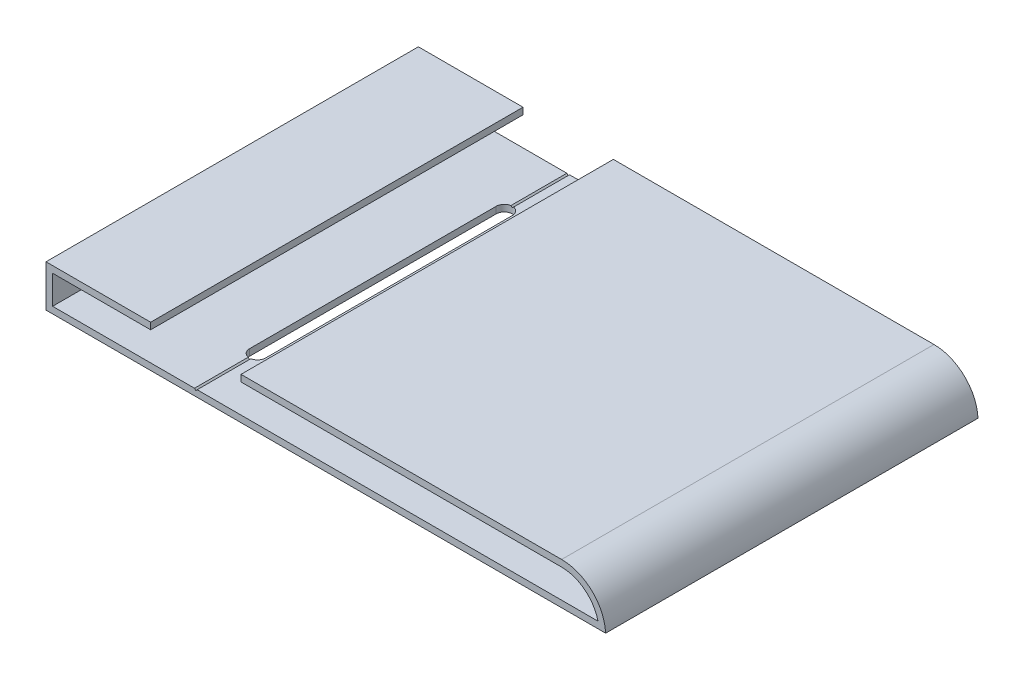
ISO-10303-21;
HEADER;
FILE_DESCRIPTION(('STEP AP214'),'2;1');
FILE_NAME('part.step','',(''),(''),'','','');
FILE_SCHEMA(('AUTOMOTIVE_DESIGN { 1 0 10303 214 1 1 1 1 }'));
ENDSEC;
DATA;
#1=APPLICATION_CONTEXT('core data for automotive mechanical design processes');
#2=APPLICATION_PROTOCOL_DEFINITION('international standard','automotive_design',2000,#1);
#3=PRODUCT_CONTEXT('',#1,'mechanical');
#4=PRODUCT('Part','Part','',(#3));
#5=PRODUCT_RELATED_PRODUCT_CATEGORY('part','',(#4));
#6=PRODUCT_DEFINITION_FORMATION('','',#4);
#7=PRODUCT_DEFINITION_CONTEXT('part definition',#1,'design');
#8=PRODUCT_DEFINITION('design','',#6,#7);
#9=PRODUCT_DEFINITION_SHAPE('','',#8);
#10=(LENGTH_UNIT() NAMED_UNIT(*) SI_UNIT(.MILLI.,.METRE.));
#11=(NAMED_UNIT(*) PLANE_ANGLE_UNIT() SI_UNIT($,.RADIAN.));
#12=(NAMED_UNIT(*) SI_UNIT($,.STERADIAN.) SOLID_ANGLE_UNIT());
#13=UNCERTAINTY_MEASURE_WITH_UNIT(LENGTH_MEASURE(1.E-05),#10,'distance_accuracy_value','');
#14=(GEOMETRIC_REPRESENTATION_CONTEXT(3) GLOBAL_UNCERTAINTY_ASSIGNED_CONTEXT((#13)) GLOBAL_UNIT_ASSIGNED_CONTEXT((#10,
#11,#12)) REPRESENTATION_CONTEXT('',''));
#15=CARTESIAN_POINT('',(0.,0.,0.));
#16=DIRECTION('',(0.,0.,1.));
#17=DIRECTION('',(1.,0.,0.));
#18=AXIS2_PLACEMENT_3D('',#15,#16,#17);
#19=CARTESIAN_POINT('',(67.3000000000008,101.999999999999,100.67082039325));
#20=DIRECTION('',(0.707106781186531,-0.707106781186564,0.));
#21=DIRECTION('',(0.707106781186564,0.707106781186531,0.));
#22=AXIS2_PLACEMENT_3D('',#19,#20,#21);
#23=PLANE('',#22);
#24=DIRECTION('',(0.,0.,-1.));
#25=VECTOR('',#24,1.);
#26=CARTESIAN_POINT('',(67.3000000000008,101.999999999999,100.67082039325));
#27=LINE('',#26,#25);
#28=CARTESIAN_POINT('',(67.3000000000008,101.999999999999,-241.5));
#29=VERTEX_POINT('',#28);
#30=CARTESIAN_POINT('',(67.3000000000008,101.999999999999,-253.699826397253));
#31=VERTEX_POINT('',#30);
#32=EDGE_CURVE('E244',#29,#31,#27,.T.);
#33=ORIENTED_EDGE('',*,*,#32,.T.);
#34=CARTESIAN_POINT('',(67.,101.699999999999,-255.5));
#35=DIRECTION('',(0.707106781186531,-0.707106781186564,0.));
#36=DIRECTION('',(0.707106781186564,0.707106781186531,0.));
#37=AXIS2_PLACEMENT_3D('',#34,#35,#36);
#38=ELLIPSE('',#37,2.58093975134183,1.82500000000778);
#39=CARTESIAN_POINT('',(67.0000000000008,101.699999999999,-253.674999999992));
#40=VERTEX_POINT('',#39);
#41=EDGE_CURVE('E206',#31,#40,#38,.T.);
#42=ORIENTED_EDGE('',*,*,#41,.T.);
#43=DIRECTION('',(0.,0.,-1.));
#44=VECTOR('',#43,1.);
#45=CARTESIAN_POINT('',(67.0000000000008,101.699999999999,100.67082039325));
#46=LINE('',#45,#44);
#47=CARTESIAN_POINT('',(67.0000000000008,101.699999999999,-241.5));
#48=VERTEX_POINT('',#47);
#49=EDGE_CURVE('E241',#48,#40,#46,.T.);
#50=ORIENTED_EDGE('',*,*,#49,.F.);
#51=DIRECTION('',(-0.707106781186564,-0.707106781186531,0.));
#52=VECTOR('',#51,1.);
#53=CARTESIAN_POINT('',(-17.3500000000009,17.3500000000017,-241.5));
#54=LINE('',#53,#52);
#55=EDGE_CURVE('E250',#29,#48,#54,.T.);
#56=ORIENTED_EDGE('',*,*,#55,.F.);
#57=EDGE_LOOP('',(#33,#42,#50,#56));
#58=FACE_BOUND('',#57,.T.);
#59=ADVANCED_FACE('F35',(#58),#23,.F.);
#60=CARTESIAN_POINT('',(67.0000000000008,101.699999999999,100.67082039325));
#61=DIRECTION('',(-0.707106781186531,-0.707106781186564,0.));
#62=DIRECTION('',(0.707106781186564,-0.707106781186531,0.));
#63=AXIS2_PLACEMENT_3D('',#60,#61,#62);
#64=PLANE('',#63);
#65=ORIENTED_EDGE('',*,*,#49,.T.);
#66=CARTESIAN_POINT('',(67.,101.7,-255.5));
#67=DIRECTION('',(-0.707106781186531,-0.707106781186564,0.));
#68=DIRECTION('',(-0.707106781186564,0.707106781186531,0.));
#69=AXIS2_PLACEMENT_3D('',#66,#67,#68);
#70=ELLIPSE('',#69,2.58093975134185,1.82500000000778);
#71=CARTESIAN_POINT('',(66.7000000000008,101.999999999999,-253.699826397252));
#72=VERTEX_POINT('',#71);
#73=EDGE_CURVE('E338',#40,#72,#70,.T.);
#74=ORIENTED_EDGE('',*,*,#73,.T.);
#75=DIRECTION('',(0.,0.,-1.));
#76=VECTOR('',#75,1.);
#77=CARTESIAN_POINT('',(66.7000000000008,101.999999999999,100.67082039325));
#78=LINE('',#77,#76);
#79=CARTESIAN_POINT('',(66.7000000000008,101.999999999999,-241.5));
#80=VERTEX_POINT('',#79);
#81=EDGE_CURVE('E237',#80,#72,#78,.T.);
#82=ORIENTED_EDGE('',*,*,#81,.F.);
#83=DIRECTION('',(-0.707106781186564,0.707106781186531,0.));
#84=VECTOR('',#83,1.);
#85=CARTESIAN_POINT('',(84.3499999999986,84.3500000000025,-241.5));
#86=LINE('',#85,#84);
#87=EDGE_CURVE('E247',#48,#80,#86,.T.);
#88=ORIENTED_EDGE('',*,*,#87,.F.);
#89=EDGE_LOOP('',(#65,#74,#82,#88));
#90=FACE_BOUND('',#89,.T.);
#91=ADVANCED_FACE('F356',(#90),#64,.F.);
#92=CARTESIAN_POINT('',(0.,110.,-421.5));
#93=DIRECTION('',(0.,-1.,0.));
#94=DIRECTION('',(0.,0.,-1.));
#95=AXIS2_PLACEMENT_3D('',#92,#93,#94);
#96=PLANE('',#95);
#97=DIRECTION('',(1.,0.,0.));
#98=VECTOR('',#97,1.);
#99=CARTESIAN_POINT('',(0.,110.,-241.5));
#100=LINE('',#99,#98);
#101=CARTESIAN_POINT('',(33.,110.,-241.5));
#102=VERTEX_POINT('',#101);
#103=CARTESIAN_POINT('',(56.75,110.,-241.5));
#104=VERTEX_POINT('',#103);
#105=EDGE_CURVE('E290',#102,#104,#100,.T.);
#106=ORIENTED_EDGE('',*,*,#105,.T.);
#107=DIRECTION('',(0.,0.,-1.));
#108=VECTOR('',#107,1.);
#109=CARTESIAN_POINT('',(56.75,110.,-169.5));
#110=LINE('',#109,#108);
#111=CARTESIAN_POINT('',(56.75,110.,-326.));
#112=VERTEX_POINT('',#111);
#113=EDGE_CURVE('E190',#104,#112,#110,.T.);
#114=ORIENTED_EDGE('',*,*,#113,.T.);
#115=DIRECTION('',(1.,0.,0.));
#116=VECTOR('',#115,1.);
#117=CARTESIAN_POINT('',(-120.,110.,-326.));
#118=LINE('',#117,#116);
#119=CARTESIAN_POINT('',(33.,110.,-326.));
#120=VERTEX_POINT('',#119);
#121=EDGE_CURVE('E254',#120,#112,#118,.T.);
#122=ORIENTED_EDGE('',*,*,#121,.F.);
#123=DIRECTION('',(0.,0.,1.));
#124=VECTOR('',#123,1.);
#125=CARTESIAN_POINT('',(33.,110.,-421.5));
#126=LINE('',#125,#124);
#127=EDGE_CURVE('E303',#120,#102,#126,.T.);
#128=ORIENTED_EDGE('',*,*,#127,.T.);
#129=EDGE_LOOP('',(#106,#114,#122,#128));
#130=FACE_BOUND('',#129,.T.);
#131=ADVANCED_FACE('F397',(#130),#96,.F.);
#132=CARTESIAN_POINT('',(0.,108.5,-421.5));
#133=DIRECTION('',(0.,-1.,0.));
#134=DIRECTION('',(0.,0.,-1.));
#135=AXIS2_PLACEMENT_3D('',#132,#133,#134);
#136=PLANE('',#135);
#137=DIRECTION('',(0.,0.,1.));
#138=VECTOR('',#137,1.);
#139=CARTESIAN_POINT('',(77.25,108.5,-421.5));
#140=LINE('',#139,#138);
#141=CARTESIAN_POINT('',(77.25,108.5,-326.));
#142=VERTEX_POINT('',#141);
#143=CARTESIAN_POINT('',(77.25,108.5,-241.5));
#144=VERTEX_POINT('',#143);
#145=EDGE_CURVE('E224',#142,#144,#140,.T.);
#146=ORIENTED_EDGE('',*,*,#145,.F.);
#147=DIRECTION('',(-1.,0.,0.));
#148=VECTOR('',#147,1.);
#149=CARTESIAN_POINT('',(0.,108.5,-326.));
#150=LINE('',#149,#148);
#151=CARTESIAN_POINT('',(150.012507822281,108.5,-326.));
#152=VERTEX_POINT('',#151);
#153=EDGE_CURVE('E270',#152,#142,#150,.T.);
#154=ORIENTED_EDGE('',*,*,#153,.F.);
#155=DIRECTION('',(0.,0.,1.));
#156=VECTOR('',#155,1.);
#157=CARTESIAN_POINT('',(150.012507822281,108.5,-421.5));
#158=LINE('',#157,#156);
#159=CARTESIAN_POINT('',(150.012507822281,108.5,-241.5));
#160=VERTEX_POINT('',#159);
#161=EDGE_CURVE('E306',#152,#160,#158,.T.);
#162=ORIENTED_EDGE('',*,*,#161,.T.);
#163=DIRECTION('',(1.,0.,0.));
#164=VECTOR('',#163,1.);
#165=CARTESIAN_POINT('',(0.,108.5,-241.5));
#166=LINE('',#165,#164);
#167=EDGE_CURVE('E278',#144,#160,#166,.T.);
#168=ORIENTED_EDGE('',*,*,#167,.F.);
#169=EDGE_LOOP('',(#146,#154,#162,#168));
#170=FACE_BOUND('',#169,.T.);
#171=ADVANCED_FACE('F417',(#170),#136,.T.);
#172=CARTESIAN_POINT('',(0.,102.,-421.5));
#173=DIRECTION('',(0.,1.,0.));
#174=DIRECTION('',(0.,0.,1.));
#175=AXIS2_PLACEMENT_3D('',#172,#173,#174);
#176=PLANE('',#175);
#177=CARTESIAN_POINT('',(67.,102.,-255.5));
#178=DIRECTION('',(0.,1.,0.));
#179=DIRECTION('',(0.,0.,1.));
#180=AXIS2_PLACEMENT_3D('',#177,#178,#179);
#181=CIRCLE('',#180,1.82500000000778);
#182=CARTESIAN_POINT('',(68.8250000000071,102.,-255.5));
#183=VERTEX_POINT('',#182);
#184=EDGE_CURVE('E215',#31,#183,#181,.T.);
#185=ORIENTED_EDGE('',*,*,#184,.F.);
#186=ORIENTED_EDGE('',*,*,#32,.F.);
#187=DIRECTION('',(-1.,0.,0.));
#188=VECTOR('',#187,1.);
#189=CARTESIAN_POINT('',(0.,102.,-241.5));
#190=LINE('',#189,#188);
#191=CARTESIAN_POINT('',(158.27386364321,102.,-241.5));
#192=VERTEX_POINT('',#191);
#193=EDGE_CURVE('E286',#192,#29,#190,.T.);
#194=ORIENTED_EDGE('',*,*,#193,.F.);
#195=DIRECTION('',(0.,0.,1.));
#196=VECTOR('',#195,1.);
#197=CARTESIAN_POINT('',(158.27386364321,102.,-421.5));
#198=LINE('',#197,#196);
#199=CARTESIAN_POINT('',(158.27386364321,102.,-326.));
#200=VERTEX_POINT('',#199);
#201=EDGE_CURVE('E302',#200,#192,#198,.T.);
#202=ORIENTED_EDGE('',*,*,#201,.F.);
#203=DIRECTION('',(1.,0.,0.));
#204=VECTOR('',#203,1.);
#205=CARTESIAN_POINT('',(0.,102.,-326.));
#206=LINE('',#205,#204);
#207=CARTESIAN_POINT('',(67.3000000000008,101.999999999999,-326.));
#208=VERTEX_POINT('',#207);
#209=EDGE_CURVE('E263',#208,#200,#206,.T.);
#210=ORIENTED_EDGE('',*,*,#209,.F.);
#211=CARTESIAN_POINT('',(67.3000000000008,101.999999999999,-313.300173602747));
#212=VERTEX_POINT('',#211);
#213=EDGE_CURVE('E203',#212,#208,#27,.T.);
#214=ORIENTED_EDGE('',*,*,#213,.F.);
#215=CARTESIAN_POINT('',(67.,102.,-311.5));
#216=DIRECTION('',(0.,1.,0.));
#217=DIRECTION('',(0.,0.,1.));
#218=AXIS2_PLACEMENT_3D('',#215,#216,#217);
#219=CIRCLE('',#218,1.82500000000778);
#220=CARTESIAN_POINT('',(68.8250000000078,102.,-311.5));
#221=VERTEX_POINT('',#220);
#222=EDGE_CURVE('E194',#221,#212,#219,.T.);
#223=ORIENTED_EDGE('',*,*,#222,.F.);
#224=DIRECTION('',(0.,0.,-1.));
#225=VECTOR('',#224,1.);
#226=CARTESIAN_POINT('',(68.8250000000071,102.,-421.5));
#227=LINE('',#226,#225);
#228=EDGE_CURVE('E183',#183,#221,#227,.T.);
#229=ORIENTED_EDGE('',*,*,#228,.F.);
#230=EDGE_LOOP('',(#185,#186,#194,#202,#210,#214,#223,#229));
#231=FACE_BOUND('',#230,.T.);
#232=ADVANCED_FACE('F201',(#231),#176,.T.);
#233=CARTESIAN_POINT('',(77.25,110.,-326.));
#234=VERTEX_POINT('',#233);
#235=CARTESIAN_POINT('',(150.012507822281,110.,-326.));
#236=VERTEX_POINT('',#235);
#237=EDGE_CURVE('E253',#234,#236,#118,.T.);
#238=ORIENTED_EDGE('',*,*,#237,.F.);
#239=DIRECTION('',(0.,0.,-1.));
#240=VECTOR('',#239,1.);
#241=CARTESIAN_POINT('',(77.25,110.,-169.5));
#242=LINE('',#241,#240);
#243=CARTESIAN_POINT('',(77.25,110.,-241.5));
#244=VERTEX_POINT('',#243);
#245=EDGE_CURVE('E222',#244,#234,#242,.T.);
#246=ORIENTED_EDGE('',*,*,#245,.F.);
#247=CARTESIAN_POINT('',(150.012507822281,110.,-241.5));
#248=VERTEX_POINT('',#247);
#249=EDGE_CURVE('E289',#244,#248,#100,.T.);
#250=ORIENTED_EDGE('',*,*,#249,.T.);
#251=DIRECTION('',(0.,0.,1.));
#252=VECTOR('',#251,1.);
#253=CARTESIAN_POINT('',(150.012507822281,110.,-421.5));
#254=LINE('',#253,#252);
#255=EDGE_CURVE('E310',#236,#248,#254,.T.);
#256=ORIENTED_EDGE('',*,*,#255,.F.);
#257=EDGE_LOOP('',(#238,#246,#250,#256));
#258=FACE_BOUND('',#257,.T.);
#259=ADVANCED_FACE('F411',(#258),#96,.F.);
#260=CARTESIAN_POINT('',(150.012507822281,100.,-421.5));
#261=DIRECTION('',(0.,0.,1.));
#262=DIRECTION('',(1.,0.,0.));
#263=AXIS2_PLACEMENT_3D('',#260,#261,#262);
#264=CYLINDRICAL_SURFACE('',#263,9.99999999999999);
#265=DIRECTION('',(0.,0.,1.));
#266=VECTOR('',#265,1.);
#267=CARTESIAN_POINT('',(160.,100.5,-421.5));
#268=LINE('',#267,#266);
#269=CARTESIAN_POINT('',(160.,100.5,-326.));
#270=VERTEX_POINT('',#269);
#271=CARTESIAN_POINT('',(160.,100.5,-241.5));
#272=VERTEX_POINT('',#271);
#273=EDGE_CURVE('E308',#270,#272,#268,.T.);
#274=ORIENTED_EDGE('',*,*,#273,.F.);
#275=CARTESIAN_POINT('',(150.012507822281,100.,-326.));
#276=DIRECTION('',(0.,0.,1.));
#277=DIRECTION('',(1.,0.,0.));
#278=AXIS2_PLACEMENT_3D('',#275,#276,#277);
#279=CIRCLE('',#278,9.99999999999999);
#280=EDGE_CURVE('E260',#270,#236,#279,.T.);
#281=ORIENTED_EDGE('',*,*,#280,.T.);
#282=ORIENTED_EDGE('',*,*,#255,.T.);
#283=CARTESIAN_POINT('',(150.012507822281,100.,-241.5));
#284=DIRECTION('',(0.,0.,-1.));
#285=DIRECTION('',(-1.,0.,0.));
#286=AXIS2_PLACEMENT_3D('',#283,#284,#285);
#287=CIRCLE('',#286,9.99999999999999);
#288=EDGE_CURVE('E293',#248,#272,#287,.T.);
#289=ORIENTED_EDGE('',*,*,#288,.T.);
#290=EDGE_LOOP('',(#274,#281,#282,#289));
#291=FACE_BOUND('',#290,.T.);
#292=ADVANCED_FACE('F407',(#291),#264,.T.);
#293=CARTESIAN_POINT('',(0.,100.5,-421.5));
#294=DIRECTION('',(0.,1.,0.));
#295=DIRECTION('',(0.,0.,1.));
#296=AXIS2_PLACEMENT_3D('',#293,#294,#295);
#297=PLANE('',#296);
#298=DIRECTION('',(0.,0.,1.));
#299=VECTOR('',#298,1.);
#300=CARTESIAN_POINT('',(65.1749999999916,100.5,-421.5));
#301=LINE('',#300,#299);
#302=CARTESIAN_POINT('',(65.1749999999916,100.5,-311.5));
#303=VERTEX_POINT('',#302);
#304=CARTESIAN_POINT('',(65.1749999999916,100.5,-255.5));
#305=VERTEX_POINT('',#304);
#306=EDGE_CURVE('E191',#303,#305,#301,.T.);
#307=ORIENTED_EDGE('',*,*,#306,.T.);
#308=CARTESIAN_POINT('',(67.,100.5,-255.5));
#309=DIRECTION('',(0.,1.,0.));
#310=DIRECTION('',(0.,0.,1.));
#311=AXIS2_PLACEMENT_3D('',#308,#309,#310);
#312=CIRCLE('',#311,1.82500000000778);
#313=CARTESIAN_POINT('',(68.8250000000071,100.5,-255.5));
#314=VERTEX_POINT('',#313);
#315=EDGE_CURVE('E217',#305,#314,#312,.T.);
#316=ORIENTED_EDGE('',*,*,#315,.T.);
#317=DIRECTION('',(0.,0.,-1.));
#318=VECTOR('',#317,1.);
#319=CARTESIAN_POINT('',(68.8250000000071,100.5,-421.5));
#320=LINE('',#319,#318);
#321=CARTESIAN_POINT('',(68.8250000000071,100.5,-311.5));
#322=VERTEX_POINT('',#321);
#323=EDGE_CURVE('E11',#314,#322,#320,.T.);
#324=ORIENTED_EDGE('',*,*,#323,.T.);
#325=CARTESIAN_POINT('',(67.,100.5,-311.5));
#326=DIRECTION('',(0.,1.,0.));
#327=DIRECTION('',(0.,0.,1.));
#328=AXIS2_PLACEMENT_3D('',#325,#326,#327);
#329=CIRCLE('',#328,1.82500000000778);
#330=EDGE_CURVE('E197',#322,#303,#329,.T.);
#331=ORIENTED_EDGE('',*,*,#330,.T.);
#332=EDGE_LOOP('',(#307,#316,#324,#331));
#333=FACE_BOUND('',#332,.T.);
#334=DIRECTION('',(0.,0.,1.));
#335=VECTOR('',#334,1.);
#336=CARTESIAN_POINT('',(33.,100.5,-421.5));
#337=LINE('',#336,#335);
#338=CARTESIAN_POINT('',(33.,100.5,-326.));
#339=VERTEX_POINT('',#338);
#340=CARTESIAN_POINT('',(33.,100.5,-241.5));
#341=VERTEX_POINT('',#340);
#342=EDGE_CURVE('E305',#339,#341,#337,.T.);
#343=ORIENTED_EDGE('',*,*,#342,.F.);
#344=DIRECTION('',(1.,0.,0.));
#345=VECTOR('',#344,1.);
#346=CARTESIAN_POINT('',(0.,100.5,-326.));
#347=LINE('',#346,#345);
#348=EDGE_CURVE('E257',#339,#270,#347,.T.);
#349=ORIENTED_EDGE('',*,*,#348,.T.);
#350=ORIENTED_EDGE('',*,*,#273,.T.);
#351=DIRECTION('',(-1.,0.,0.));
#352=VECTOR('',#351,1.);
#353=CARTESIAN_POINT('',(0.,100.5,-241.5));
#354=LINE('',#353,#352);
#355=EDGE_CURVE('E296',#272,#341,#354,.T.);
#356=ORIENTED_EDGE('',*,*,#355,.T.);
#357=EDGE_LOOP('',(#343,#349,#350,#356));
#358=FACE_BOUND('',#357,.T.);
#359=ADVANCED_FACE('F366',(#333,#358),#297,.F.);
#360=CARTESIAN_POINT('',(150.012507822281,100.,-421.5));
#361=DIRECTION('',(0.,0.,1.));
#362=DIRECTION('',(1.,0.,0.));
#363=AXIS2_PLACEMENT_3D('',#360,#361,#362);
#364=CYLINDRICAL_SURFACE('',#363,8.49999999999999);
#365=CARTESIAN_POINT('',(150.012507822281,100.,-326.));
#366=DIRECTION('',(0.,0.,1.));
#367=DIRECTION('',(1.,0.,0.));
#368=AXIS2_PLACEMENT_3D('',#365,#366,#367);
#369=CIRCLE('',#368,8.49999999999999);
#370=EDGE_CURVE('E273',#200,#152,#369,.T.);
#371=ORIENTED_EDGE('',*,*,#370,.F.);
#372=ORIENTED_EDGE('',*,*,#201,.T.);
#373=CARTESIAN_POINT('',(150.012507822281,100.,-241.5));
#374=DIRECTION('',(0.,0.,-1.));
#375=DIRECTION('',(-1.,0.,0.));
#376=AXIS2_PLACEMENT_3D('',#373,#374,#375);
#377=CIRCLE('',#376,8.49999999999999);
#378=EDGE_CURVE('E275',#160,#192,#377,.T.);
#379=ORIENTED_EDGE('',*,*,#378,.F.);
#380=ORIENTED_EDGE('',*,*,#161,.F.);
#381=EDGE_LOOP('',(#371,#372,#379,#380));
#382=FACE_BOUND('',#381,.T.);
#383=ADVANCED_FACE('F37',(#382),#364,.F.);
#384=DIRECTION('',(0.,0.,-1.));
#385=VECTOR('',#384,1.);
#386=CARTESIAN_POINT('',(56.75,108.5,-421.5));
#387=LINE('',#386,#385);
#388=CARTESIAN_POINT('',(56.75,108.5,-241.5));
#389=VERTEX_POINT('',#388);
#390=CARTESIAN_POINT('',(56.75,108.5,-326.));
#391=VERTEX_POINT('',#390);
#392=EDGE_CURVE('E231',#389,#391,#387,.T.);
#393=ORIENTED_EDGE('',*,*,#392,.F.);
#394=CARTESIAN_POINT('',(34.5,108.5,-241.5));
#395=VERTEX_POINT('',#394);
#396=EDGE_CURVE('E279',#395,#389,#166,.T.);
#397=ORIENTED_EDGE('',*,*,#396,.F.);
#398=DIRECTION('',(0.,0.,1.));
#399=VECTOR('',#398,1.);
#400=CARTESIAN_POINT('',(34.5,108.5,-421.5));
#401=LINE('',#400,#399);
#402=CARTESIAN_POINT('',(34.5,108.5,-326.));
#403=VERTEX_POINT('',#402);
#404=EDGE_CURVE('E318',#403,#395,#401,.T.);
#405=ORIENTED_EDGE('',*,*,#404,.F.);
#406=EDGE_CURVE('E269',#391,#403,#150,.T.);
#407=ORIENTED_EDGE('',*,*,#406,.F.);
#408=EDGE_LOOP('',(#393,#397,#405,#407));
#409=FACE_BOUND('',#408,.T.);
#410=ADVANCED_FACE('F389',(#409),#136,.T.);
#411=CARTESIAN_POINT('',(34.5,0.,-421.5));
#412=DIRECTION('',(1.,0.,0.));
#413=DIRECTION('',(0.,0.,-1.));
#414=AXIS2_PLACEMENT_3D('',#411,#412,#413);
#415=PLANE('',#414);
#416=DIRECTION('',(0.,-1.,0.));
#417=VECTOR('',#416,1.);
#418=CARTESIAN_POINT('',(34.5,0.,-326.));
#419=LINE('',#418,#417);
#420=CARTESIAN_POINT('',(34.5,102.,-326.));
#421=VERTEX_POINT('',#420);
#422=EDGE_CURVE('E267',#403,#421,#419,.T.);
#423=ORIENTED_EDGE('',*,*,#422,.F.);
#424=ORIENTED_EDGE('',*,*,#404,.T.);
#425=DIRECTION('',(0.,1.,0.));
#426=VECTOR('',#425,1.);
#427=CARTESIAN_POINT('',(34.5,0.,-241.5));
#428=LINE('',#427,#426);
#429=CARTESIAN_POINT('',(34.5,102.,-241.5));
#430=VERTEX_POINT('',#429);
#431=EDGE_CURVE('E282',#430,#395,#428,.T.);
#432=ORIENTED_EDGE('',*,*,#431,.F.);
#433=DIRECTION('',(0.,0.,1.));
#434=VECTOR('',#433,1.);
#435=CARTESIAN_POINT('',(34.5,102.,-421.5));
#436=LINE('',#435,#434);
#437=EDGE_CURVE('E315',#421,#430,#436,.T.);
#438=ORIENTED_EDGE('',*,*,#437,.F.);
#439=EDGE_LOOP('',(#423,#424,#432,#438));
#440=FACE_BOUND('',#439,.T.);
#441=ADVANCED_FACE('F383',(#440),#415,.T.);
#442=CARTESIAN_POINT('',(67.,102.,-255.5));
#443=DIRECTION('',(0.,1.,0.));
#444=DIRECTION('',(0.,0.,1.));
#445=AXIS2_PLACEMENT_3D('',#442,#443,#444);
#446=CIRCLE('',#445,1.82500000000778);
#447=CARTESIAN_POINT('',(65.1749999999915,102.,-255.5));
#448=VERTEX_POINT('',#447);
#449=EDGE_CURVE('E213',#448,#72,#446,.T.);
#450=ORIENTED_EDGE('',*,*,#449,.F.);
#451=DIRECTION('',(0.,0.,1.));
#452=VECTOR('',#451,1.);
#453=CARTESIAN_POINT('',(65.1749999999915,102.,-421.5));
#454=LINE('',#453,#452);
#455=CARTESIAN_POINT('',(65.1749999999915,102.,-311.5));
#456=VERTEX_POINT('',#455);
#457=EDGE_CURVE('E43',#456,#448,#454,.T.);
#458=ORIENTED_EDGE('',*,*,#457,.F.);
#459=CARTESIAN_POINT('',(67.,102.,-311.5));
#460=DIRECTION('',(0.,1.,0.));
#461=DIRECTION('',(0.,0.,1.));
#462=AXIS2_PLACEMENT_3D('',#459,#460,#461);
#463=CIRCLE('',#462,1.82500000000778);
#464=CARTESIAN_POINT('',(66.7000000000008,101.999999999999,-313.300173602747));
#465=VERTEX_POINT('',#464);
#466=EDGE_CURVE('E204',#465,#456,#463,.T.);
#467=ORIENTED_EDGE('',*,*,#466,.F.);
#468=CARTESIAN_POINT('',(66.7000000000008,101.999999999999,-326.));
#469=VERTEX_POINT('',#468);
#470=EDGE_CURVE('E240',#465,#469,#78,.T.);
#471=ORIENTED_EDGE('',*,*,#470,.T.);
#472=EDGE_CURVE('E264',#421,#469,#206,.T.);
#473=ORIENTED_EDGE('',*,*,#472,.F.);
#474=ORIENTED_EDGE('',*,*,#437,.T.);
#475=EDGE_CURVE('E285',#80,#430,#190,.T.);
#476=ORIENTED_EDGE('',*,*,#475,.F.);
#477=ORIENTED_EDGE('',*,*,#81,.T.);
#478=EDGE_LOOP('',(#450,#458,#467,#471,#473,#474,#476,#477));
#479=FACE_BOUND('',#478,.T.);
#480=ADVANCED_FACE('F353',(#479),#176,.T.);
#481=CARTESIAN_POINT('',(33.,0.,-421.5));
#482=DIRECTION('',(1.,0.,0.));
#483=DIRECTION('',(0.,0.,-1.));
#484=AXIS2_PLACEMENT_3D('',#481,#482,#483);
#485=PLANE('',#484);
#486=ORIENTED_EDGE('',*,*,#127,.F.);
#487=DIRECTION('',(0.,-1.,0.));
#488=VECTOR('',#487,1.);
#489=CARTESIAN_POINT('',(33.,0.,-326.));
#490=LINE('',#489,#488);
#491=EDGE_CURVE('E313',#120,#339,#490,.T.);
#492=ORIENTED_EDGE('',*,*,#491,.T.);
#493=ORIENTED_EDGE('',*,*,#342,.T.);
#494=DIRECTION('',(0.,1.,0.));
#495=VECTOR('',#494,1.);
#496=CARTESIAN_POINT('',(33.,0.,-241.5));
#497=LINE('',#496,#495);
#498=EDGE_CURVE('E299',#341,#102,#497,.T.);
#499=ORIENTED_EDGE('',*,*,#498,.T.);
#500=EDGE_LOOP('',(#486,#492,#493,#499));
#501=FACE_BOUND('',#500,.T.);
#502=ADVANCED_FACE('F399',(#501),#485,.F.);
#503=CARTESIAN_POINT('',(0.,0.,-241.5));
#504=DIRECTION('',(0.,0.,-1.));
#505=DIRECTION('',(-1.,0.,0.));
#506=AXIS2_PLACEMENT_3D('',#503,#504,#505);
#507=PLANE('',#506);
#508=ORIENTED_EDGE('',*,*,#396,.T.);
#509=DIRECTION('',(0.,1.,0.));
#510=VECTOR('',#509,1.);
#511=CARTESIAN_POINT('',(56.75,0.,-241.5));
#512=LINE('',#511,#510);
#513=EDGE_CURVE('E233',#389,#104,#512,.T.);
#514=ORIENTED_EDGE('',*,*,#513,.T.);
#515=ORIENTED_EDGE('',*,*,#105,.F.);
#516=ORIENTED_EDGE('',*,*,#498,.F.);
#517=ORIENTED_EDGE('',*,*,#355,.F.);
#518=ORIENTED_EDGE('',*,*,#288,.F.);
#519=ORIENTED_EDGE('',*,*,#249,.F.);
#520=DIRECTION('',(0.,-1.,0.));
#521=VECTOR('',#520,1.);
#522=CARTESIAN_POINT('',(77.25,0.,-241.5));
#523=LINE('',#522,#521);
#524=EDGE_CURVE('E228',#244,#144,#523,.T.);
#525=ORIENTED_EDGE('',*,*,#524,.T.);
#526=ORIENTED_EDGE('',*,*,#167,.T.);
#527=ORIENTED_EDGE('',*,*,#378,.T.);
#528=ORIENTED_EDGE('',*,*,#193,.T.);
#529=ORIENTED_EDGE('',*,*,#55,.T.);
#530=ORIENTED_EDGE('',*,*,#87,.T.);
#531=ORIENTED_EDGE('',*,*,#475,.T.);
#532=ORIENTED_EDGE('',*,*,#431,.T.);
#533=EDGE_LOOP('',(#508,#514,#515,#516,#517,#518,#519,#525,#526,#527,#528,#529,#530,#531,#532));
#534=FACE_BOUND('',#533,.T.);
#535=ADVANCED_FACE('F359',(#534),#507,.F.);
#536=CARTESIAN_POINT('',(-120.,-110.,-326.));
#537=DIRECTION('',(0.,0.,1.));
#538=DIRECTION('',(1.,0.,0.));
#539=AXIS2_PLACEMENT_3D('',#536,#537,#538);
#540=PLANE('',#539);
#541=ORIENTED_EDGE('',*,*,#121,.T.);
#542=DIRECTION('',(0.,-1.,0.));
#543=VECTOR('',#542,1.);
#544=CARTESIAN_POINT('',(56.75,-110.,-326.));
#545=LINE('',#544,#543);
#546=EDGE_CURVE('E333',#112,#391,#545,.T.);
#547=ORIENTED_EDGE('',*,*,#546,.T.);
#548=ORIENTED_EDGE('',*,*,#406,.T.);
#549=ORIENTED_EDGE('',*,*,#422,.T.);
#550=ORIENTED_EDGE('',*,*,#472,.T.);
#551=DIRECTION('',(0.707106781186564,-0.707106781186531,0.));
#552=VECTOR('',#551,1.);
#553=CARTESIAN_POINT('',(79.3499999999958,89.350000000005,-326.));
#554=LINE('',#553,#552);
#555=CARTESIAN_POINT('',(67.0000000000008,101.699999999999,-326.));
#556=VERTEX_POINT('',#555);
#557=EDGE_CURVE('E324',#469,#556,#554,.T.);
#558=ORIENTED_EDGE('',*,*,#557,.T.);
#559=DIRECTION('',(0.707106781186564,0.707106781186531,0.));
#560=VECTOR('',#559,1.);
#561=CARTESIAN_POINT('',(-132.350000000004,-97.6499999999958,-326.));
#562=LINE('',#561,#560);
#563=EDGE_CURVE('E327',#556,#208,#562,.T.);
#564=ORIENTED_EDGE('',*,*,#563,.T.);
#565=ORIENTED_EDGE('',*,*,#209,.T.);
#566=ORIENTED_EDGE('',*,*,#370,.T.);
#567=ORIENTED_EDGE('',*,*,#153,.T.);
#568=DIRECTION('',(0.,1.,0.));
#569=VECTOR('',#568,1.);
#570=CARTESIAN_POINT('',(77.25,-110.,-326.));
#571=LINE('',#570,#569);
#572=EDGE_CURVE('E330',#142,#234,#571,.T.);
#573=ORIENTED_EDGE('',*,*,#572,.T.);
#574=ORIENTED_EDGE('',*,*,#237,.T.);
#575=ORIENTED_EDGE('',*,*,#280,.F.);
#576=ORIENTED_EDGE('',*,*,#348,.F.);
#577=ORIENTED_EDGE('',*,*,#491,.F.);
#578=EDGE_LOOP('',(#541,#547,#548,#549,#550,#558,#564,#565,#566,#567,#573,#574,#575,#576,#577));
#579=FACE_BOUND('',#578,.T.);
#580=ADVANCED_FACE('F393',(#579),#540,.F.);
#581=CARTESIAN_POINT('',(67.0000000000008,101.699999999999,-313.325000000008));
#582=VERTEX_POINT('',#581);
#583=EDGE_CURVE('E236',#582,#556,#46,.T.);
#584=ORIENTED_EDGE('',*,*,#583,.F.);
#585=CARTESIAN_POINT('',(67.,101.699999999999,-311.5));
#586=DIRECTION('',(0.707106781186531,-0.707106781186564,0.));
#587=DIRECTION('',(0.707106781186564,0.707106781186531,0.));
#588=AXIS2_PLACEMENT_3D('',#585,#586,#587);
#589=ELLIPSE('',#588,2.58093975134183,1.82500000000778);
#590=EDGE_CURVE('E58',#582,#212,#589,.T.);
#591=ORIENTED_EDGE('',*,*,#590,.T.);
#592=ORIENTED_EDGE('',*,*,#213,.T.);
#593=ORIENTED_EDGE('',*,*,#563,.F.);
#594=EDGE_LOOP('',(#584,#591,#592,#593));
#595=FACE_BOUND('',#594,.T.);
#596=ADVANCED_FACE('F371',(#595),#23,.F.);
#597=ORIENTED_EDGE('',*,*,#470,.F.);
#598=CARTESIAN_POINT('',(67.,101.7,-311.5));
#599=DIRECTION('',(-0.707106781186531,-0.707106781186564,0.));
#600=DIRECTION('',(-0.707106781186564,0.707106781186531,0.));
#601=AXIS2_PLACEMENT_3D('',#598,#599,#600);
#602=ELLIPSE('',#601,2.58093975134185,1.82500000000778);
#603=EDGE_CURVE('E336',#465,#582,#602,.T.);
#604=ORIENTED_EDGE('',*,*,#603,.T.);
#605=ORIENTED_EDGE('',*,*,#583,.T.);
#606=ORIENTED_EDGE('',*,*,#557,.F.);
#607=EDGE_LOOP('',(#597,#604,#605,#606));
#608=FACE_BOUND('',#607,.T.);
#609=ADVANCED_FACE('F376',(#608),#64,.F.);
#610=CARTESIAN_POINT('',(77.25,110.,-169.5));
#611=DIRECTION('',(1.,0.,0.));
#612=DIRECTION('',(0.,0.,-1.));
#613=AXIS2_PLACEMENT_3D('',#610,#611,#612);
#614=PLANE('',#613);
#615=ORIENTED_EDGE('',*,*,#245,.T.);
#616=ORIENTED_EDGE('',*,*,#572,.F.);
#617=ORIENTED_EDGE('',*,*,#145,.T.);
#618=ORIENTED_EDGE('',*,*,#524,.F.);
#619=EDGE_LOOP('',(#615,#616,#617,#618));
#620=FACE_BOUND('',#619,.T.);
#621=ADVANCED_FACE('F423',(#620),#614,.F.);
#622=CARTESIAN_POINT('',(56.75,110.,-169.5));
#623=DIRECTION('',(-1.,0.,0.));
#624=DIRECTION('',(0.,0.,1.));
#625=AXIS2_PLACEMENT_3D('',#622,#623,#624);
#626=PLANE('',#625);
#627=ORIENTED_EDGE('',*,*,#392,.T.);
#628=ORIENTED_EDGE('',*,*,#546,.F.);
#629=ORIENTED_EDGE('',*,*,#113,.F.);
#630=ORIENTED_EDGE('',*,*,#513,.F.);
#631=EDGE_LOOP('',(#627,#628,#629,#630));
#632=FACE_BOUND('',#631,.T.);
#633=ADVANCED_FACE('F392',(#632),#626,.F.);
#634=CARTESIAN_POINT('',(68.8250000000078,-110.000000000001,-311.5));
#635=DIRECTION('',(1.,0.,0.));
#636=DIRECTION('',(0.,1.,0.));
#637=AXIS2_PLACEMENT_3D('',#634,#635,#636);
#638=PLANE('',#637);
#639=ORIENTED_EDGE('',*,*,#228,.T.);
#640=DIRECTION('',(0.,1.,0.));
#641=VECTOR('',#640,1.);
#642=CARTESIAN_POINT('',(68.8250000000085,-110.000000000001,-311.5));
#643=LINE('',#642,#641);
#644=EDGE_CURVE('E50',#322,#221,#643,.T.);
#645=ORIENTED_EDGE('',*,*,#644,.F.);
#646=ORIENTED_EDGE('',*,*,#323,.F.);
#647=DIRECTION('',(0.,1.,0.));
#648=VECTOR('',#647,1.);
#649=CARTESIAN_POINT('',(68.8250000000078,-110.000000000001,-255.5));
#650=LINE('',#649,#648);
#651=EDGE_CURVE('E186',#314,#183,#650,.T.);
#652=ORIENTED_EDGE('',*,*,#651,.T.);
#653=EDGE_LOOP('',(#639,#645,#646,#652));
#654=FACE_BOUND('',#653,.T.);
#655=ADVANCED_FACE('F184',(#654),#638,.F.);
#656=CARTESIAN_POINT('',(65.1749999999923,-110.000000000001,-255.5));
#657=DIRECTION('',(-1.,0.,0.));
#658=DIRECTION('',(0.,-1.,0.));
#659=AXIS2_PLACEMENT_3D('',#656,#657,#658);
#660=PLANE('',#659);
#661=DIRECTION('',(0.,1.,0.));
#662=VECTOR('',#661,1.);
#663=CARTESIAN_POINT('',(65.1749999999923,-110.000000000001,-311.5));
#664=LINE('',#663,#662);
#665=EDGE_CURVE('E198',#303,#456,#664,.T.);
#666=ORIENTED_EDGE('',*,*,#665,.T.);
#667=ORIENTED_EDGE('',*,*,#457,.T.);
#668=DIRECTION('',(0.,1.,0.));
#669=VECTOR('',#668,1.);
#670=CARTESIAN_POINT('',(65.1749999999923,-110.000000000001,-255.5));
#671=LINE('',#670,#669);
#672=EDGE_CURVE('E346',#305,#448,#671,.T.);
#673=ORIENTED_EDGE('',*,*,#672,.F.);
#674=ORIENTED_EDGE('',*,*,#306,.F.);
#675=EDGE_LOOP('',(#666,#667,#673,#674));
#676=FACE_BOUND('',#675,.T.);
#677=ADVANCED_FACE('F345',(#676),#660,.F.);
#678=CARTESIAN_POINT('',(67.0000000000007,-110.000000000001,-255.5));
#679=DIRECTION('',(0.,1.,0.));
#680=DIRECTION('',(-1.,0.,0.));
#681=AXIS2_PLACEMENT_3D('',#678,#679,#680);
#682=CYLINDRICAL_SURFACE('',#681,1.82500000000778);
#683=ORIENTED_EDGE('',*,*,#672,.T.);
#684=ORIENTED_EDGE('',*,*,#449,.T.);
#685=ORIENTED_EDGE('',*,*,#73,.F.);
#686=ORIENTED_EDGE('',*,*,#41,.F.);
#687=ORIENTED_EDGE('',*,*,#184,.T.);
#688=ORIENTED_EDGE('',*,*,#651,.F.);
#689=ORIENTED_EDGE('',*,*,#315,.F.);
#690=EDGE_LOOP('',(#683,#684,#685,#686,#687,#688,#689));
#691=FACE_BOUND('',#690,.T.);
#692=ADVANCED_FACE('F351',(#691),#682,.F.);
#693=CARTESIAN_POINT('',(67.0000000000007,-110.000000000001,-311.5));
#694=DIRECTION('',(0.,1.,0.));
#695=DIRECTION('',(-1.,0.,0.));
#696=AXIS2_PLACEMENT_3D('',#693,#694,#695);
#697=CYLINDRICAL_SURFACE('',#696,1.82500000000778);
#698=ORIENTED_EDGE('',*,*,#644,.T.);
#699=ORIENTED_EDGE('',*,*,#222,.T.);
#700=ORIENTED_EDGE('',*,*,#590,.F.);
#701=ORIENTED_EDGE('',*,*,#603,.F.);
#702=ORIENTED_EDGE('',*,*,#466,.T.);
#703=ORIENTED_EDGE('',*,*,#665,.F.);
#704=ORIENTED_EDGE('',*,*,#330,.F.);
#705=EDGE_LOOP('',(#698,#699,#700,#701,#702,#703,#704));
#706=FACE_BOUND('',#705,.T.);
#707=ADVANCED_FACE('F193',(#706),#697,.F.);
#708=CLOSED_SHELL('',(#59,#91,#131,#171,#232,#259,#292,#359,#383,#410,#441,#480,#502,#535,#580,
#596,#609,#621,#633,#655,#677,#692,#707));
#709=MANIFOLD_SOLID_BREP('B2',#708);
#710=ADVANCED_BREP_SHAPE_REPRESENTATION('',(#18,#709),#14);
#711=SHAPE_DEFINITION_REPRESENTATION(#9,#710);
ENDSEC;
END-ISO-10303-21;
